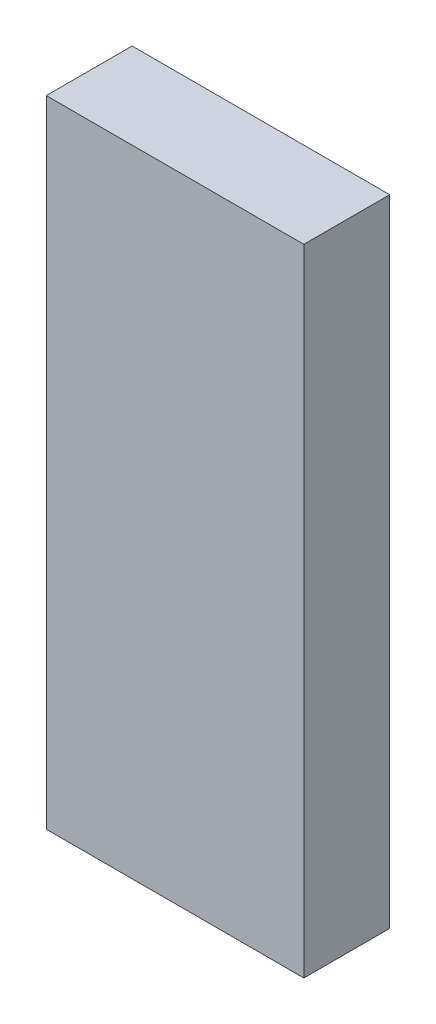
ISO-10303-21;
HEADER;
FILE_DESCRIPTION(('STEP AP214'),'2;1');
FILE_NAME('part.step','',(''),(''),'','','');
FILE_SCHEMA(('AUTOMOTIVE_DESIGN { 1 0 10303 214 1 1 1 1 }'));
ENDSEC;
DATA;
#1=APPLICATION_CONTEXT('core data for automotive mechanical design processes');
#2=APPLICATION_PROTOCOL_DEFINITION('international standard','automotive_design',2000,#1);
#3=PRODUCT_CONTEXT('',#1,'mechanical');
#4=PRODUCT('Part','Part','',(#3));
#5=PRODUCT_RELATED_PRODUCT_CATEGORY('part','',(#4));
#6=PRODUCT_DEFINITION_FORMATION('','',#4);
#7=PRODUCT_DEFINITION_CONTEXT('part definition',#1,'design');
#8=PRODUCT_DEFINITION('design','',#6,#7);
#9=PRODUCT_DEFINITION_SHAPE('','',#8);
#10=(LENGTH_UNIT() NAMED_UNIT(*) SI_UNIT(.MILLI.,.METRE.));
#11=(NAMED_UNIT(*) PLANE_ANGLE_UNIT() SI_UNIT($,.RADIAN.));
#12=(NAMED_UNIT(*) SI_UNIT($,.STERADIAN.) SOLID_ANGLE_UNIT());
#13=UNCERTAINTY_MEASURE_WITH_UNIT(LENGTH_MEASURE(1.E-05),#10,'distance_accuracy_value','');
#14=(GEOMETRIC_REPRESENTATION_CONTEXT(3) GLOBAL_UNCERTAINTY_ASSIGNED_CONTEXT((#13)) GLOBAL_UNIT_ASSIGNED_CONTEXT((#10,
#11,#12)) REPRESENTATION_CONTEXT('',''));
#15=CARTESIAN_POINT('',(0.,0.,0.));
#16=DIRECTION('',(0.,0.,1.));
#17=DIRECTION('',(1.,0.,0.));
#18=AXIS2_PLACEMENT_3D('',#15,#16,#17);
#19=CARTESIAN_POINT('',(19.05,46.99,6.35));
#20=DIRECTION('',(-1.,0.,0.));
#21=DIRECTION('',(0.,0.,1.));
#22=AXIS2_PLACEMENT_3D('',#19,#20,#21);
#23=PLANE('',#22);
#24=DIRECTION('',(0.,0.,-1.));
#25=VECTOR('',#24,1.);
#26=CARTESIAN_POINT('',(19.05,-46.99,6.35));
#27=LINE('',#26,#25);
#28=CARTESIAN_POINT('',(19.05,-46.99,6.35));
#29=VERTEX_POINT('',#28);
#30=CARTESIAN_POINT('',(19.05,-46.99,-6.35));
#31=VERTEX_POINT('',#30);
#32=EDGE_CURVE('E97',#29,#31,#27,.T.);
#33=ORIENTED_EDGE('',*,*,#32,.T.);
#34=DIRECTION('',(0.,-1.,0.));
#35=VECTOR('',#34,1.);
#36=CARTESIAN_POINT('',(19.05,46.99,-6.35));
#37=LINE('',#36,#35);
#38=CARTESIAN_POINT('',(19.05,46.99,-6.35));
#39=VERTEX_POINT('',#38);
#40=EDGE_CURVE('E11',#39,#31,#37,.T.);
#41=ORIENTED_EDGE('',*,*,#40,.F.);
#42=DIRECTION('',(0.,0.,-1.));
#43=VECTOR('',#42,1.);
#44=CARTESIAN_POINT('',(19.05,46.99,6.35));
#45=LINE('',#44,#43);
#46=CARTESIAN_POINT('',(19.05,46.99,6.35));
#47=VERTEX_POINT('',#46);
#48=EDGE_CURVE('E85',#47,#39,#45,.T.);
#49=ORIENTED_EDGE('',*,*,#48,.F.);
#50=DIRECTION('',(0.,-1.,0.));
#51=VECTOR('',#50,1.);
#52=CARTESIAN_POINT('',(19.05,46.99,6.35));
#53=LINE('',#52,#51);
#54=EDGE_CURVE('E93',#47,#29,#53,.T.);
#55=ORIENTED_EDGE('',*,*,#54,.T.);
#56=EDGE_LOOP('',(#33,#41,#49,#55));
#57=FACE_BOUND('',#56,.T.);
#58=ADVANCED_FACE('F34',(#57),#23,.F.);
#59=CARTESIAN_POINT('',(-19.05,46.99,-6.35));
#60=DIRECTION('',(0.,0.,1.));
#61=DIRECTION('',(1.,0.,0.));
#62=AXIS2_PLACEMENT_3D('',#59,#60,#61);
#63=PLANE('',#62);
#64=DIRECTION('',(-1.,0.,0.));
#65=VECTOR('',#64,1.);
#66=CARTESIAN_POINT('',(-19.05,-46.99,-6.35));
#67=LINE('',#66,#65);
#68=CARTESIAN_POINT('',(-19.05,-46.99,-6.35));
#69=VERTEX_POINT('',#68);
#70=EDGE_CURVE('E89',#31,#69,#67,.T.);
#71=ORIENTED_EDGE('',*,*,#70,.T.);
#72=DIRECTION('',(0.,-1.,0.));
#73=VECTOR('',#72,1.);
#74=CARTESIAN_POINT('',(-19.05,46.99,-6.35));
#75=LINE('',#74,#73);
#76=CARTESIAN_POINT('',(-19.05,46.99,-6.35));
#77=VERTEX_POINT('',#76);
#78=EDGE_CURVE('E42',#77,#69,#75,.T.);
#79=ORIENTED_EDGE('',*,*,#78,.F.);
#80=DIRECTION('',(-1.,0.,0.));
#81=VECTOR('',#80,1.);
#82=CARTESIAN_POINT('',(-19.05,46.99,-6.35));
#83=LINE('',#82,#81);
#84=EDGE_CURVE('E80',#39,#77,#83,.T.);
#85=ORIENTED_EDGE('',*,*,#84,.F.);
#86=ORIENTED_EDGE('',*,*,#40,.T.);
#87=EDGE_LOOP('',(#71,#79,#85,#86));
#88=FACE_BOUND('',#87,.T.);
#89=ADVANCED_FACE('F88',(#88),#63,.F.);
#90=CARTESIAN_POINT('',(-19.05,46.99,6.35));
#91=DIRECTION('',(1.,0.,0.));
#92=DIRECTION('',(0.,0.,-1.));
#93=AXIS2_PLACEMENT_3D('',#90,#91,#92);
#94=PLANE('',#93);
#95=DIRECTION('',(0.,0.,1.));
#96=VECTOR('',#95,1.);
#97=CARTESIAN_POINT('',(-19.05,-46.99,6.35));
#98=LINE('',#97,#96);
#99=CARTESIAN_POINT('',(-19.05,-46.99,6.35));
#100=VERTEX_POINT('',#99);
#101=EDGE_CURVE('E67',#69,#100,#98,.T.);
#102=ORIENTED_EDGE('',*,*,#101,.T.);
#103=DIRECTION('',(0.,-1.,0.));
#104=VECTOR('',#103,1.);
#105=CARTESIAN_POINT('',(-19.05,46.99,6.35));
#106=LINE('',#105,#104);
#107=CARTESIAN_POINT('',(-19.05,46.99,6.35));
#108=VERTEX_POINT('',#107);
#109=EDGE_CURVE('E90',#108,#100,#106,.T.);
#110=ORIENTED_EDGE('',*,*,#109,.F.);
#111=DIRECTION('',(0.,0.,1.));
#112=VECTOR('',#111,1.);
#113=CARTESIAN_POINT('',(-19.05,46.99,6.35));
#114=LINE('',#113,#112);
#115=EDGE_CURVE('E83',#77,#108,#114,.T.);
#116=ORIENTED_EDGE('',*,*,#115,.F.);
#117=ORIENTED_EDGE('',*,*,#78,.T.);
#118=EDGE_LOOP('',(#102,#110,#116,#117));
#119=FACE_BOUND('',#118,.T.);
#120=ADVANCED_FACE('F91',(#119),#94,.F.);
#121=CARTESIAN_POINT('',(-19.05,46.99,6.35));
#122=DIRECTION('',(0.,0.,-1.));
#123=DIRECTION('',(-1.,0.,0.));
#124=AXIS2_PLACEMENT_3D('',#121,#122,#123);
#125=PLANE('',#124);
#126=DIRECTION('',(1.,0.,0.));
#127=VECTOR('',#126,1.);
#128=CARTESIAN_POINT('',(-19.05,-46.99,6.35));
#129=LINE('',#128,#127);
#130=EDGE_CURVE('E73',#100,#29,#129,.T.);
#131=ORIENTED_EDGE('',*,*,#130,.T.);
#132=ORIENTED_EDGE('',*,*,#54,.F.);
#133=DIRECTION('',(1.,0.,0.));
#134=VECTOR('',#133,1.);
#135=CARTESIAN_POINT('',(-19.05,46.99,6.35));
#136=LINE('',#135,#134);
#137=EDGE_CURVE('E50',#108,#47,#136,.T.);
#138=ORIENTED_EDGE('',*,*,#137,.F.);
#139=ORIENTED_EDGE('',*,*,#109,.T.);
#140=EDGE_LOOP('',(#131,#132,#138,#139));
#141=FACE_BOUND('',#140,.T.);
#142=ADVANCED_FACE('F104',(#141),#125,.F.);
#143=CARTESIAN_POINT('',(0.,46.99,0.));
#144=DIRECTION('',(0.,-1.,0.));
#145=DIRECTION('',(0.,0.,-1.));
#146=AXIS2_PLACEMENT_3D('',#143,#144,#145);
#147=PLANE('',#146);
#148=ORIENTED_EDGE('',*,*,#48,.T.);
#149=ORIENTED_EDGE('',*,*,#84,.T.);
#150=ORIENTED_EDGE('',*,*,#115,.T.);
#151=ORIENTED_EDGE('',*,*,#137,.T.);
#152=EDGE_LOOP('',(#148,#149,#150,#151));
#153=FACE_BOUND('',#152,.T.);
#154=ADVANCED_FACE('F81',(#153),#147,.F.);
#155=CARTESIAN_POINT('',(0.,-46.99,0.));
#156=DIRECTION('',(0.,-1.,0.));
#157=DIRECTION('',(0.,0.,-1.));
#158=AXIS2_PLACEMENT_3D('',#155,#156,#157);
#159=PLANE('',#158);
#160=ORIENTED_EDGE('',*,*,#32,.F.);
#161=ORIENTED_EDGE('',*,*,#130,.F.);
#162=ORIENTED_EDGE('',*,*,#101,.F.);
#163=ORIENTED_EDGE('',*,*,#70,.F.);
#164=EDGE_LOOP('',(#160,#161,#162,#163));
#165=FACE_BOUND('',#164,.T.);
#166=ADVANCED_FACE('F107',(#165),#159,.T.);
#167=CLOSED_SHELL('',(#58,#89,#120,#142,#154,#166));
#168=MANIFOLD_SOLID_BREP('B2',#167);
#169=ADVANCED_BREP_SHAPE_REPRESENTATION('',(#18,#168),#14);
#170=SHAPE_DEFINITION_REPRESENTATION(#9,#169);
ENDSEC;
END-ISO-10303-21;
